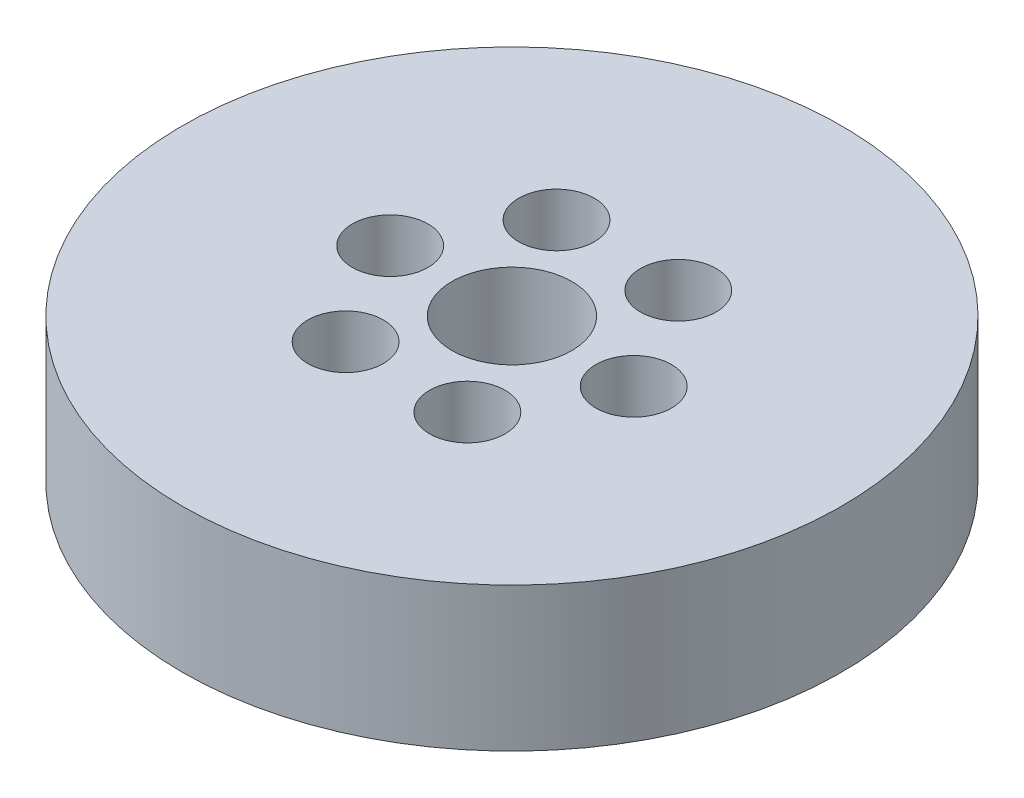
ISO-10303-21;
HEADER;
FILE_DESCRIPTION(('STEP AP214'),'2;1');
FILE_NAME('part.step','',(''),(''),'','','');
FILE_SCHEMA(('AUTOMOTIVE_DESIGN { 1 0 10303 214 1 1 1 1 }'));
ENDSEC;
DATA;
#1=APPLICATION_CONTEXT('core data for automotive mechanical design processes');
#2=APPLICATION_PROTOCOL_DEFINITION('international standard','automotive_design',2000,#1);
#3=PRODUCT_CONTEXT('',#1,'mechanical');
#4=PRODUCT('Part','Part','',(#3));
#5=PRODUCT_RELATED_PRODUCT_CATEGORY('part','',(#4));
#6=PRODUCT_DEFINITION_FORMATION('','',#4);
#7=PRODUCT_DEFINITION_CONTEXT('part definition',#1,'design');
#8=PRODUCT_DEFINITION('design','',#6,#7);
#9=PRODUCT_DEFINITION_SHAPE('','',#8);
#10=(LENGTH_UNIT() NAMED_UNIT(*) SI_UNIT(.MILLI.,.METRE.));
#11=(NAMED_UNIT(*) PLANE_ANGLE_UNIT() SI_UNIT($,.RADIAN.));
#12=(NAMED_UNIT(*) SI_UNIT($,.STERADIAN.) SOLID_ANGLE_UNIT());
#13=UNCERTAINTY_MEASURE_WITH_UNIT(LENGTH_MEASURE(1.E-05),#10,'distance_accuracy_value','');
#14=(GEOMETRIC_REPRESENTATION_CONTEXT(3) GLOBAL_UNCERTAINTY_ASSIGNED_CONTEXT((#13)) GLOBAL_UNIT_ASSIGNED_CONTEXT((#10,
#11,#12)) REPRESENTATION_CONTEXT('',''));
#15=CARTESIAN_POINT('',(0.,0.,0.));
#16=DIRECTION('',(0.,0.,1.));
#17=DIRECTION('',(1.,0.,0.));
#18=AXIS2_PLACEMENT_3D('',#15,#16,#17);
#19=CARTESIAN_POINT('',(0.,24.,0.));
#20=DIRECTION('',(0.,-1.,0.));
#21=DIRECTION('',(0.,0.,-1.));
#22=AXIS2_PLACEMENT_3D('',#19,#20,#21);
#23=CYLINDRICAL_SURFACE('',#22,55.);
#24=CARTESIAN_POINT('',(0.,24.,0.));
#25=DIRECTION('',(0.,1.,0.));
#26=DIRECTION('',(0.,0.,1.));
#27=AXIS2_PLACEMENT_3D('',#24,#25,#26);
#28=CIRCLE('',#27,55.);
#29=CARTESIAN_POINT('',(0.,24.,55.));
#30=VERTEX_POINT('',#29);
#31=EDGE_CURVE('E10',#30,#30,#28,.T.);
#32=ORIENTED_EDGE('',*,*,#31,.F.);
#33=EDGE_LOOP('',(#32));
#34=FACE_BOUND('',#33,.T.);
#35=CARTESIAN_POINT('',(0.,0.,0.));
#36=DIRECTION('',(0.,1.,0.));
#37=DIRECTION('',(0.,0.,1.));
#38=AXIS2_PLACEMENT_3D('',#35,#36,#37);
#39=CIRCLE('',#38,55.);
#40=CARTESIAN_POINT('',(0.,0.,55.));
#41=VERTEX_POINT('',#40);
#42=EDGE_CURVE('E37',#41,#41,#39,.T.);
#43=ORIENTED_EDGE('',*,*,#42,.T.);
#44=EDGE_LOOP('',(#43));
#45=FACE_BOUND('',#44,.T.);
#46=ADVANCED_FACE('F40',(#34,#45),#23,.T.);
#47=CARTESIAN_POINT('',(0.,24.,0.));
#48=DIRECTION('',(0.,1.,0.));
#49=DIRECTION('',(0.,0.,1.));
#50=AXIS2_PLACEMENT_3D('',#47,#48,#49);
#51=PLANE('',#50);
#52=CARTESIAN_POINT('',(-10.1614131957319,24.,-17.6000839317081));
#53=DIRECTION('',(0.,1.,0.));
#54=DIRECTION('',(-0.866025403784433,0.,0.50000000000001));
#55=AXIS2_PLACEMENT_3D('',#52,#53,#54);
#56=CIRCLE('',#55,6.30892819996485);
#57=CARTESIAN_POINT('',(-15.6251052875535,24.,-14.4456198317256));
#58=VERTEX_POINT('',#57);
#59=EDGE_CURVE('E70',#58,#58,#56,.T.);
#60=ORIENTED_EDGE('',*,*,#59,.F.);
#61=EDGE_LOOP('',(#60));
#62=FACE_BOUND('',#61,.T.);
#63=CARTESIAN_POINT('',(10.1614131957316,24.,-17.6000839317083));
#64=DIRECTION('',(0.,1.,0.));
#65=DIRECTION('',(-0.866025403784443,0.,-0.499999999999992));
#66=AXIS2_PLACEMENT_3D('',#63,#64,#65);
#67=CIRCLE('',#66,6.30892819996485);
#68=CARTESIAN_POINT('',(4.69772110390996,24.,-20.7545480316907));
#69=VERTEX_POINT('',#68);
#70=EDGE_CURVE('E71',#69,#69,#67,.T.);
#71=ORIENTED_EDGE('',*,*,#70,.F.);
#72=EDGE_LOOP('',(#71));
#73=FACE_BOUND('',#72,.T.);
#74=CARTESIAN_POINT('',(20.3228263914635,24.,0.));
#75=DIRECTION('',(0.,1.,0.));
#76=DIRECTION('',(0.,0.,-1.));
#77=AXIS2_PLACEMENT_3D('',#74,#75,#76);
#78=CIRCLE('',#77,6.30892819996485);
#79=CARTESIAN_POINT('',(20.3228263914635,24.,-6.30892819996485));
#80=VERTEX_POINT('',#79);
#81=EDGE_CURVE('E78',#80,#80,#78,.T.);
#82=ORIENTED_EDGE('',*,*,#81,.F.);
#83=EDGE_LOOP('',(#82));
#84=FACE_BOUND('',#83,.T.);
#85=CARTESIAN_POINT('',(10.1614131957318,24.,17.6000839317082));
#86=DIRECTION('',(0.,1.,0.));
#87=DIRECTION('',(0.866025403784436,0.,-0.500000000000004));
#88=AXIS2_PLACEMENT_3D('',#85,#86,#87);
#89=CIRCLE('',#88,6.30892819996485);
#90=CARTESIAN_POINT('',(15.6251052875534,24.,14.4456198317257));
#91=VERTEX_POINT('',#90);
#92=EDGE_CURVE('E84',#91,#91,#89,.T.);
#93=ORIENTED_EDGE('',*,*,#92,.F.);
#94=EDGE_LOOP('',(#93));
#95=FACE_BOUND('',#94,.T.);
#96=CARTESIAN_POINT('',(-10.1614131957317,24.,17.6000839317082));
#97=DIRECTION('',(0.,1.,0.));
#98=DIRECTION('',(0.86602540378444,0.,0.499999999999998));
#99=AXIS2_PLACEMENT_3D('',#96,#97,#98);
#100=CIRCLE('',#99,6.30892819996485);
#101=CARTESIAN_POINT('',(-4.69772110391011,24.,20.7545480316906));
#102=VERTEX_POINT('',#101);
#103=EDGE_CURVE('E61',#102,#102,#100,.T.);
#104=ORIENTED_EDGE('',*,*,#103,.F.);
#105=EDGE_LOOP('',(#104));
#106=FACE_BOUND('',#105,.T.);
#107=CARTESIAN_POINT('',(-20.3228263914635,24.,0.));
#108=DIRECTION('',(0.,1.,0.));
#109=DIRECTION('',(0.,0.,1.));
#110=AXIS2_PLACEMENT_3D('',#107,#108,#109);
#111=CIRCLE('',#110,6.30892819996485);
#112=CARTESIAN_POINT('',(-20.3228263914635,24.,6.30892819996485));
#113=VERTEX_POINT('',#112);
#114=EDGE_CURVE('E54',#113,#113,#111,.T.);
#115=ORIENTED_EDGE('',*,*,#114,.F.);
#116=EDGE_LOOP('',(#115));
#117=FACE_BOUND('',#116,.T.);
#118=CARTESIAN_POINT('',(0.,24.,0.));
#119=DIRECTION('',(0.,1.,0.));
#120=DIRECTION('',(0.,0.,1.));
#121=AXIS2_PLACEMENT_3D('',#118,#119,#120);
#122=CIRCLE('',#121,10.);
#123=CARTESIAN_POINT('',(0.,24.,10.));
#124=VERTEX_POINT('',#123);
#125=EDGE_CURVE('E50',#124,#124,#122,.T.);
#126=ORIENTED_EDGE('',*,*,#125,.F.);
#127=EDGE_LOOP('',(#126));
#128=FACE_BOUND('',#127,.T.);
#129=ORIENTED_EDGE('',*,*,#31,.T.);
#130=EDGE_LOOP('',(#129));
#131=FACE_BOUND('',#130,.T.);
#132=ADVANCED_FACE('F99',(#62,#73,#84,#95,#106,#117,#128,#131),#51,.T.);
#133=CARTESIAN_POINT('',(0.,0.,0.));
#134=DIRECTION('',(0.,1.,0.));
#135=DIRECTION('',(0.,0.,1.));
#136=AXIS2_PLACEMENT_3D('',#133,#134,#135);
#137=PLANE('',#136);
#138=CARTESIAN_POINT('',(0.,0.,0.));
#139=DIRECTION('',(0.,1.,0.));
#140=DIRECTION('',(0.,0.,1.));
#141=AXIS2_PLACEMENT_3D('',#138,#139,#140);
#142=CIRCLE('',#141,10.);
#143=CARTESIAN_POINT('',(0.,0.,10.));
#144=VERTEX_POINT('',#143);
#145=EDGE_CURVE('E47',#144,#144,#142,.T.);
#146=ORIENTED_EDGE('',*,*,#145,.T.);
#147=EDGE_LOOP('',(#146));
#148=FACE_BOUND('',#147,.T.);
#149=ORIENTED_EDGE('',*,*,#42,.F.);
#150=EDGE_LOOP('',(#149));
#151=FACE_BOUND('',#150,.T.);
#152=ADVANCED_FACE('F103',(#148,#151),#137,.F.);
#153=CARTESIAN_POINT('',(0.,24.,0.));
#154=DIRECTION('',(0.,-1.,0.));
#155=DIRECTION('',(0.,0.,-1.));
#156=AXIS2_PLACEMENT_3D('',#153,#154,#155);
#157=CYLINDRICAL_SURFACE('',#156,10.);
#158=ORIENTED_EDGE('',*,*,#125,.T.);
#159=EDGE_LOOP('',(#158));
#160=FACE_BOUND('',#159,.T.);
#161=ORIENTED_EDGE('',*,*,#145,.F.);
#162=EDGE_LOOP('',(#161));
#163=FACE_BOUND('',#162,.T.);
#164=ADVANCED_FACE('F115',(#160,#163),#157,.F.);
#165=CARTESIAN_POINT('',(-20.3228263914635,6.32709017138954,0.));
#166=DIRECTION('',(0.,1.,0.));
#167=DIRECTION('',(0.,0.,1.));
#168=AXIS2_PLACEMENT_3D('',#165,#166,#167);
#169=CYLINDRICAL_SURFACE('',#168,6.30892819996485);
#170=CARTESIAN_POINT('',(-20.3228263914635,6.32709017138954,0.));
#171=DIRECTION('',(0.,1.,0.));
#172=DIRECTION('',(0.,0.,1.));
#173=AXIS2_PLACEMENT_3D('',#170,#171,#172);
#174=CIRCLE('',#173,6.30892819996485);
#175=CARTESIAN_POINT('',(-20.3228263914635,6.32709017138954,6.30892819996485));
#176=VERTEX_POINT('',#175);
#177=EDGE_CURVE('E55',#176,#176,#174,.T.);
#178=ORIENTED_EDGE('',*,*,#177,.F.);
#179=EDGE_LOOP('',(#178));
#180=FACE_BOUND('',#179,.T.);
#181=ORIENTED_EDGE('',*,*,#114,.T.);
#182=EDGE_LOOP('',(#181));
#183=FACE_BOUND('',#182,.T.);
#184=ADVANCED_FACE('F113',(#180,#183),#169,.F.);
#185=CARTESIAN_POINT('',(-20.3228263914635,6.32709017138954,0.));
#186=DIRECTION('',(0.,1.,0.));
#187=DIRECTION('',(0.,0.,1.));
#188=AXIS2_PLACEMENT_3D('',#185,#186,#187);
#189=PLANE('',#188);
#190=ORIENTED_EDGE('',*,*,#177,.T.);
#191=EDGE_LOOP('',(#190));
#192=FACE_BOUND('',#191,.T.);
#193=ADVANCED_FACE('F144',(#192),#189,.T.);
#194=CARTESIAN_POINT('',(-10.1614131957317,6.32709017138954,17.6000839317082));
#195=DIRECTION('',(0.,1.,0.));
#196=DIRECTION('',(0.,0.,1.));
#197=AXIS2_PLACEMENT_3D('',#194,#195,#196);
#198=CYLINDRICAL_SURFACE('',#197,6.30892819996485);
#199=CARTESIAN_POINT('',(-10.1614131957317,6.32709017138954,17.6000839317082));
#200=DIRECTION('',(0.,1.,0.));
#201=DIRECTION('',(0.86602540378444,0.,0.499999999999998));
#202=AXIS2_PLACEMENT_3D('',#199,#200,#201);
#203=CIRCLE('',#202,6.30892819996485);
#204=CARTESIAN_POINT('',(-4.69772110391011,6.32709017138954,20.7545480316906));
#205=VERTEX_POINT('',#204);
#206=EDGE_CURVE('E59',#205,#205,#203,.T.);
#207=ORIENTED_EDGE('',*,*,#206,.F.);
#208=EDGE_LOOP('',(#207));
#209=FACE_BOUND('',#208,.T.);
#210=ORIENTED_EDGE('',*,*,#103,.T.);
#211=EDGE_LOOP('',(#210));
#212=FACE_BOUND('',#211,.T.);
#213=ADVANCED_FACE('F153',(#209,#212),#198,.F.);
#214=CARTESIAN_POINT('',(-10.1614131957317,6.32709017138954,17.6000839317082));
#215=DIRECTION('',(0.,1.,0.));
#216=DIRECTION('',(0.86602540378444,0.,0.499999999999998));
#217=AXIS2_PLACEMENT_3D('',#214,#215,#216);
#218=PLANE('',#217);
#219=ORIENTED_EDGE('',*,*,#206,.T.);
#220=EDGE_LOOP('',(#219));
#221=FACE_BOUND('',#220,.T.);
#222=ADVANCED_FACE('F96',(#221),#218,.T.);
#223=CARTESIAN_POINT('',(10.1614131957318,6.32709017138954,17.6000839317082));
#224=DIRECTION('',(0.,1.,0.));
#225=DIRECTION('',(0.,0.,1.));
#226=AXIS2_PLACEMENT_3D('',#223,#224,#225);
#227=CYLINDRICAL_SURFACE('',#226,6.30892819996485);
#228=CARTESIAN_POINT('',(10.1614131957318,6.32709017138954,17.6000839317082));
#229=DIRECTION('',(0.,1.,0.));
#230=DIRECTION('',(0.866025403784436,0.,-0.500000000000004));
#231=AXIS2_PLACEMENT_3D('',#228,#229,#230);
#232=CIRCLE('',#231,6.30892819996485);
#233=CARTESIAN_POINT('',(15.6251052875534,6.32709017138954,14.4456198317257));
#234=VERTEX_POINT('',#233);
#235=EDGE_CURVE('E63',#234,#234,#232,.T.);
#236=ORIENTED_EDGE('',*,*,#235,.F.);
#237=EDGE_LOOP('',(#236));
#238=FACE_BOUND('',#237,.T.);
#239=ORIENTED_EDGE('',*,*,#92,.T.);
#240=EDGE_LOOP('',(#239));
#241=FACE_BOUND('',#240,.T.);
#242=ADVANCED_FACE('F91',(#238,#241),#227,.F.);
#243=CARTESIAN_POINT('',(10.1614131957318,6.32709017138954,17.6000839317082));
#244=DIRECTION('',(0.,1.,0.));
#245=DIRECTION('',(0.866025403784436,0.,-0.500000000000004));
#246=AXIS2_PLACEMENT_3D('',#243,#244,#245);
#247=PLANE('',#246);
#248=ORIENTED_EDGE('',*,*,#235,.T.);
#249=EDGE_LOOP('',(#248));
#250=FACE_BOUND('',#249,.T.);
#251=ADVANCED_FACE('F93',(#250),#247,.T.);
#252=CARTESIAN_POINT('',(20.3228263914635,6.32709017138954,0.));
#253=DIRECTION('',(0.,1.,0.));
#254=DIRECTION('',(0.,0.,1.));
#255=AXIS2_PLACEMENT_3D('',#252,#253,#254);
#256=CYLINDRICAL_SURFACE('',#255,6.30892819996485);
#257=CARTESIAN_POINT('',(20.3228263914635,6.32709017138954,0.));
#258=DIRECTION('',(0.,1.,0.));
#259=DIRECTION('',(0.,0.,-1.));
#260=AXIS2_PLACEMENT_3D('',#257,#258,#259);
#261=CIRCLE('',#260,6.30892819996485);
#262=CARTESIAN_POINT('',(20.3228263914635,6.32709017138954,-6.30892819996485));
#263=VERTEX_POINT('',#262);
#264=EDGE_CURVE('E85',#263,#263,#261,.T.);
#265=ORIENTED_EDGE('',*,*,#264,.F.);
#266=EDGE_LOOP('',(#265));
#267=FACE_BOUND('',#266,.T.);
#268=ORIENTED_EDGE('',*,*,#81,.T.);
#269=EDGE_LOOP('',(#268));
#270=FACE_BOUND('',#269,.T.);
#271=ADVANCED_FACE('F187',(#267,#270),#256,.F.);
#272=CARTESIAN_POINT('',(20.3228263914635,6.32709017138954,0.));
#273=DIRECTION('',(0.,1.,0.));
#274=DIRECTION('',(0.,0.,-1.));
#275=AXIS2_PLACEMENT_3D('',#272,#273,#274);
#276=PLANE('',#275);
#277=ORIENTED_EDGE('',*,*,#264,.T.);
#278=EDGE_LOOP('',(#277));
#279=FACE_BOUND('',#278,.T.);
#280=ADVANCED_FACE('F198',(#279),#276,.T.);
#281=CARTESIAN_POINT('',(10.1614131957316,6.32709017138954,-17.6000839317083));
#282=DIRECTION('',(0.,1.,0.));
#283=DIRECTION('',(0.,0.,1.));
#284=AXIS2_PLACEMENT_3D('',#281,#282,#283);
#285=CYLINDRICAL_SURFACE('',#284,6.30892819996485);
#286=CARTESIAN_POINT('',(10.1614131957316,6.32709017138954,-17.6000839317083));
#287=DIRECTION('',(0.,1.,0.));
#288=DIRECTION('',(-0.866025403784443,0.,-0.499999999999992));
#289=AXIS2_PLACEMENT_3D('',#286,#287,#288);
#290=CIRCLE('',#289,6.30892819996485);
#291=CARTESIAN_POINT('',(4.69772110390996,6.32709017138954,-20.7545480316907));
#292=VERTEX_POINT('',#291);
#293=EDGE_CURVE('E76',#292,#292,#290,.T.);
#294=ORIENTED_EDGE('',*,*,#293,.F.);
#295=EDGE_LOOP('',(#294));
#296=FACE_BOUND('',#295,.T.);
#297=ORIENTED_EDGE('',*,*,#70,.T.);
#298=EDGE_LOOP('',(#297));
#299=FACE_BOUND('',#298,.T.);
#300=ADVANCED_FACE('F202',(#296,#299),#285,.F.);
#301=CARTESIAN_POINT('',(10.1614131957316,6.32709017138954,-17.6000839317083));
#302=DIRECTION('',(0.,1.,0.));
#303=DIRECTION('',(-0.866025403784443,0.,-0.499999999999992));
#304=AXIS2_PLACEMENT_3D('',#301,#302,#303);
#305=PLANE('',#304);
#306=ORIENTED_EDGE('',*,*,#293,.T.);
#307=EDGE_LOOP('',(#306));
#308=FACE_BOUND('',#307,.T.);
#309=ADVANCED_FACE('F212',(#308),#305,.T.);
#310=CARTESIAN_POINT('',(-10.1614131957319,6.32709017138954,-17.6000839317081));
#311=DIRECTION('',(0.,1.,0.));
#312=DIRECTION('',(0.,0.,1.));
#313=AXIS2_PLACEMENT_3D('',#310,#311,#312);
#314=CYLINDRICAL_SURFACE('',#313,6.30892819996485);
#315=CARTESIAN_POINT('',(-10.1614131957319,6.32709017138954,-17.6000839317081));
#316=DIRECTION('',(0.,1.,0.));
#317=DIRECTION('',(-0.866025403784433,0.,0.50000000000001));
#318=AXIS2_PLACEMENT_3D('',#315,#316,#317);
#319=CIRCLE('',#318,6.30892819996485);
#320=CARTESIAN_POINT('',(-15.6251052875535,6.32709017138954,-14.4456198317256));
#321=VERTEX_POINT('',#320);
#322=EDGE_CURVE('E69',#321,#321,#319,.T.);
#323=ORIENTED_EDGE('',*,*,#322,.F.);
#324=EDGE_LOOP('',(#323));
#325=FACE_BOUND('',#324,.T.);
#326=ORIENTED_EDGE('',*,*,#59,.T.);
#327=EDGE_LOOP('',(#326));
#328=FACE_BOUND('',#327,.T.);
#329=ADVANCED_FACE('F224',(#325,#328),#314,.F.);
#330=CARTESIAN_POINT('',(-10.1614131957319,6.32709017138954,-17.6000839317081));
#331=DIRECTION('',(0.,1.,0.));
#332=DIRECTION('',(-0.866025403784433,0.,0.50000000000001));
#333=AXIS2_PLACEMENT_3D('',#330,#331,#332);
#334=PLANE('',#333);
#335=ORIENTED_EDGE('',*,*,#322,.T.);
#336=EDGE_LOOP('',(#335));
#337=FACE_BOUND('',#336,.T.);
#338=ADVANCED_FACE('F235',(#337),#334,.T.);
#339=CLOSED_SHELL('',(#46,#132,#152,#164,#184,#193,#213,#222,#242,#251,#271,#280,#300,#309,#329,#338));
#340=MANIFOLD_SOLID_BREP('B2',#339);
#341=ADVANCED_BREP_SHAPE_REPRESENTATION('',(#18,#340),#14);
#342=SHAPE_DEFINITION_REPRESENTATION(#9,#341);
ENDSEC;
END-ISO-10303-21;
